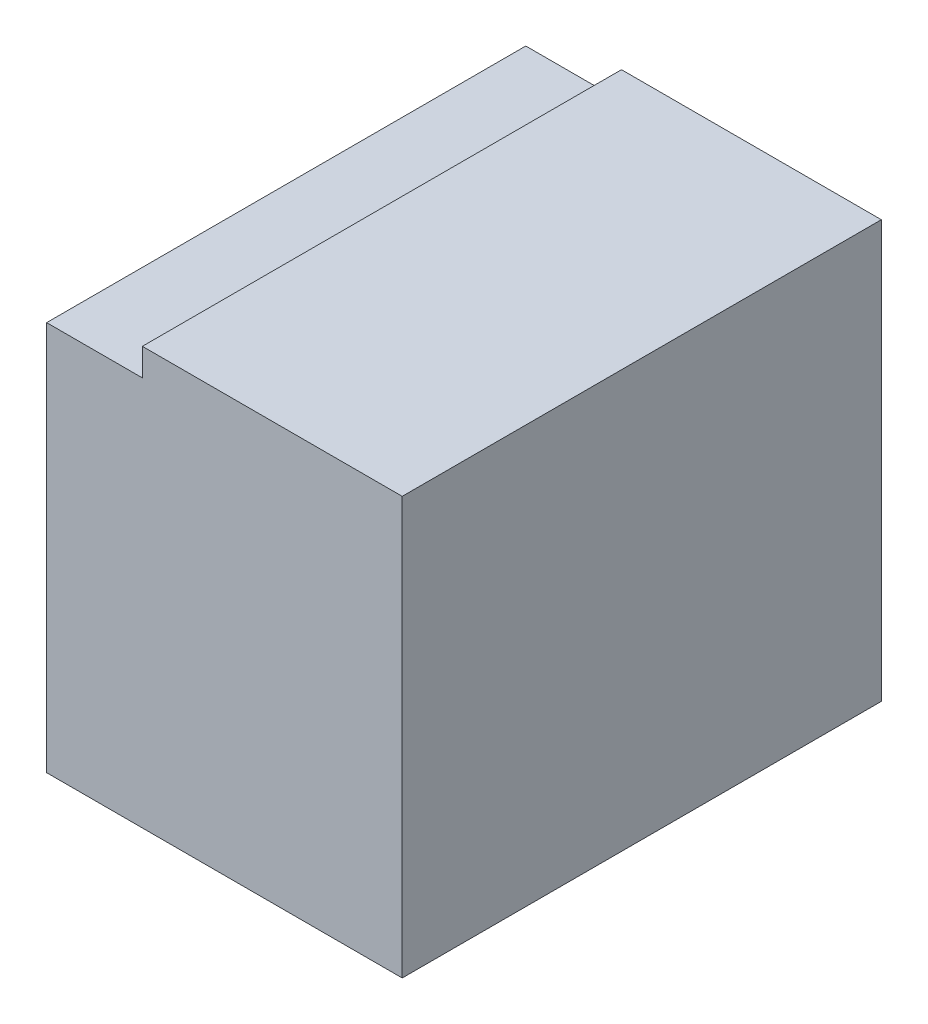
ISO-10303-21;
HEADER;
FILE_DESCRIPTION(('STEP AP214'),'2;1');
FILE_NAME('part.step','',(''),(''),'','','');
FILE_SCHEMA(('AUTOMOTIVE_DESIGN { 1 0 10303 214 1 1 1 1 }'));
ENDSEC;
DATA;
#1=APPLICATION_CONTEXT('core data for automotive mechanical design processes');
#2=APPLICATION_PROTOCOL_DEFINITION('international standard','automotive_design',2000,#1);
#3=PRODUCT_CONTEXT('',#1,'mechanical');
#4=PRODUCT('Part','Part','',(#3));
#5=PRODUCT_RELATED_PRODUCT_CATEGORY('part','',(#4));
#6=PRODUCT_DEFINITION_FORMATION('','',#4);
#7=PRODUCT_DEFINITION_CONTEXT('part definition',#1,'design');
#8=PRODUCT_DEFINITION('design','',#6,#7);
#9=PRODUCT_DEFINITION_SHAPE('','',#8);
#10=(LENGTH_UNIT() NAMED_UNIT(*) SI_UNIT(.MILLI.,.METRE.));
#11=(NAMED_UNIT(*) PLANE_ANGLE_UNIT() SI_UNIT($,.RADIAN.));
#12=(NAMED_UNIT(*) SI_UNIT($,.STERADIAN.) SOLID_ANGLE_UNIT());
#13=UNCERTAINTY_MEASURE_WITH_UNIT(LENGTH_MEASURE(1.E-05),#10,'distance_accuracy_value','');
#14=(GEOMETRIC_REPRESENTATION_CONTEXT(3) GLOBAL_UNCERTAINTY_ASSIGNED_CONTEXT((#13)) GLOBAL_UNIT_ASSIGNED_CONTEXT((#10,
#11,#12)) REPRESENTATION_CONTEXT('',''));
#15=CARTESIAN_POINT('',(0.,0.,0.));
#16=DIRECTION('',(0.,0.,1.));
#17=DIRECTION('',(1.,0.,0.));
#18=AXIS2_PLACEMENT_3D('',#15,#16,#17);
#19=CARTESIAN_POINT('',(-69.80498377743,-2.051384398456,-41.29331973764));
#20=DIRECTION('',(-1.,1.338607343168E-12,0.));
#21=DIRECTION('',(-1.338607343168E-12,-1.,0.));
#22=AXIS2_PLACEMENT_3D('',#19,#20,#21);
#23=PLANE('',#22);
#24=DIRECTION('',(0.,0.,1.));
#25=VECTOR('',#24,1.);
#26=CARTESIAN_POINT('',(-69.80498377743,-2.126384400525,-44.48106509227));
#27=LINE('',#26,#25);
#28=CARTESIAN_POINT('',(-69.8049837774301,-2.12638440051825,-47.4236397376319));
#29=VERTEX_POINT('',#28);
#30=CARTESIAN_POINT('',(-69.8049837774301,-2.12638440051825,-47.0733197376419));
#31=VERTEX_POINT('',#30);
#32=EDGE_CURVE('E88',#29,#31,#27,.T.);
#33=ORIENTED_EDGE('',*,*,#32,.T.);
#34=DIRECTION('',(0.,-1.,1.798143292204E-12));
#35=VECTOR('',#34,1.);
#36=CARTESIAN_POINT('',(-69.80498377743,-0.806384399451,-47.07331973765));
#37=LINE('',#36,#35);
#38=CARTESIAN_POINT('',(-69.8049837774299,-1.841385122797,-47.073319737642));
#39=VERTEX_POINT('',#38);
#40=EDGE_CURVE('E80',#39,#31,#37,.T.);
#41=ORIENTED_EDGE('',*,*,#40,.F.);
#42=DIRECTION('',(0.,0.,-1.));
#43=VECTOR('',#42,1.);
#44=CARTESIAN_POINT('',(-69.80498377743,-1.841385122797,-47.24863973798));
#45=LINE('',#44,#43);
#46=CARTESIAN_POINT('',(-69.8049837774299,-1.8413850990795,-47.423639737632));
#47=VERTEX_POINT('',#46);
#48=EDGE_CURVE('E19',#39,#47,#45,.T.);
#49=ORIENTED_EDGE('',*,*,#48,.T.);
#50=DIRECTION('',(0.,1.,-1.798143292204E-12));
#51=VECTOR('',#50,1.);
#52=CARTESIAN_POINT('',(-69.80498377743,-0.806384399449,-47.42363973764));
#53=LINE('',#52,#51);
#54=EDGE_CURVE('E70',#29,#47,#53,.T.);
#55=ORIENTED_EDGE('',*,*,#54,.F.);
#56=EDGE_LOOP('',(#33,#41,#49,#55));
#57=FACE_BOUND('',#56,.T.);
#58=ADVANCED_FACE('F16',(#57),#23,.T.);
#59=CARTESIAN_POINT('',(-72.39500445623,-1.841385122797,-47.24863973798));
#60=DIRECTION('',(0.,-1.,0.));
#61=DIRECTION('',(0.,0.,-1.));
#62=AXIS2_PLACEMENT_3D('',#59,#60,#61);
#63=PLANE('',#62);
#64=DIRECTION('',(1.,0.,0.));
#65=VECTOR('',#64,1.);
#66=CARTESIAN_POINT('',(-73.12019237886,-1.841385122797,-47.0733197376481));
#67=LINE('',#66,#65);
#68=CARTESIAN_POINT('',(-69.7350044661175,-1.841385122797,-47.073319737642));
#69=VERTEX_POINT('',#68);
#70=EDGE_CURVE('E99',#69,#39,#67,.F.);
#71=ORIENTED_EDGE('',*,*,#70,.F.);
#72=DIRECTION('',(0.,0.,-1.));
#73=VECTOR('',#72,1.);
#74=CARTESIAN_POINT('',(-69.73500447043,-1.841385122797,-47.24847974281));
#75=LINE('',#74,#73);
#76=CARTESIAN_POINT('',(-69.7350044622475,-1.8413850990795,-47.423639737632));
#77=VERTEX_POINT('',#76);
#78=EDGE_CURVE('E77',#69,#77,#75,.T.);
#79=ORIENTED_EDGE('',*,*,#78,.T.);
#80=DIRECTION('',(1.,0.,0.));
#81=VECTOR('',#80,1.);
#82=CARTESIAN_POINT('',(-74.98500392881,-1.841385027927,-47.4236397376381));
#83=LINE('',#82,#81);
#84=EDGE_CURVE('E66',#47,#77,#83,.T.);
#85=ORIENTED_EDGE('',*,*,#84,.F.);
#86=ORIENTED_EDGE('',*,*,#48,.F.);
#87=EDGE_LOOP('',(#71,#79,#85,#86));
#88=FACE_BOUND('',#87,.T.);
#89=ADVANCED_FACE('F84',(#88),#63,.F.);
#90=CARTESIAN_POINT('',(-69.73500447043,-1.691384921744,-47.24847974281));
#91=DIRECTION('',(1.,0.,0.));
#92=DIRECTION('',(0.,0.,-1.));
#93=AXIS2_PLACEMENT_3D('',#90,#91,#92);
#94=PLANE('',#93);
#95=DIRECTION('',(0.,1.,-1.798143292204E-12));
#96=VECTOR('',#95,1.);
#97=CARTESIAN_POINT('',(-69.73500445952,-0.806384399449,-47.42363973764));
#98=LINE('',#97,#96);
#99=CARTESIAN_POINT('',(-69.73500446327,-1.821384382683,-47.4236397376341));
#100=VERTEX_POINT('',#99);
#101=EDGE_CURVE('E86',#77,#100,#98,.T.);
#102=ORIENTED_EDGE('',*,*,#101,.F.);
#103=ORIENTED_EDGE('',*,*,#78,.F.);
#104=DIRECTION('',(0.,-1.,1.798143292204E-12));
#105=VECTOR('',#104,1.);
#106=CARTESIAN_POINT('',(-69.73500446409,-0.806384399451,-47.07331973765));
#107=LINE('',#106,#105);
#108=CARTESIAN_POINT('',(-69.735004465555,-1.821384394565,-47.0733197376441));
#109=VERTEX_POINT('',#108);
#110=EDGE_CURVE('E96',#109,#69,#107,.T.);
#111=ORIENTED_EDGE('',*,*,#110,.F.);
#112=DIRECTION('',(0.,0.,1.));
#113=VECTOR('',#112,1.);
#114=CARTESIAN_POINT('',(-69.73500446361,-1.821384400506,-47.24863973729));
#115=LINE('',#114,#113);
#116=EDGE_CURVE('E105',#100,#109,#115,.T.);
#117=ORIENTED_EDGE('',*,*,#116,.F.);
#118=EDGE_LOOP('',(#102,#103,#111,#117));
#119=FACE_BOUND('',#118,.T.);
#120=ADVANCED_FACE('F131',(#119),#94,.F.);
#121=CARTESIAN_POINT('',(-74.98500392881,-0.806384399449,-47.42363973764));
#122=DIRECTION('',(0.,-1.798143292204E-12,-1.));
#123=DIRECTION('',(0.,1.,-1.798143292204E-12));
#124=AXIS2_PLACEMENT_3D('',#121,#122,#123);
#125=PLANE('',#124);
#126=ORIENTED_EDGE('',*,*,#84,.T.);
#127=ORIENTED_EDGE('',*,*,#101,.T.);
#128=DIRECTION('',(1.,0.,0.));
#129=VECTOR('',#128,1.);
#130=CARTESIAN_POINT('',(-72.3950044578,-1.821384400506,-47.42363973763));
#131=LINE('',#130,#129);
#132=CARTESIAN_POINT('',(-69.545004437785,-1.821384388624,-47.4236397376341));
#133=VERTEX_POINT('',#132);
#134=EDGE_CURVE('E102',#133,#100,#131,.F.);
#135=ORIENTED_EDGE('',*,*,#134,.F.);
#136=DIRECTION('',(0.,1.,0.));
#137=VECTOR('',#136,1.);
#138=CARTESIAN_POINT('',(-69.54500443493,-2.057013797608,-47.42363973763));
#139=LINE('',#138,#137);
#140=CARTESIAN_POINT('',(-69.545004437785,-2.12638440051825,-47.4236397376338));
#141=VERTEX_POINT('',#140);
#142=EDGE_CURVE('E107',#133,#141,#139,.F.);
#143=ORIENTED_EDGE('',*,*,#142,.T.);
#144=DIRECTION('',(1.,0.,0.));
#145=VECTOR('',#144,1.);
#146=CARTESIAN_POINT('',(-72.08658338126,-2.126384400525,-47.42363973763));
#147=LINE('',#146,#145);
#148=EDGE_CURVE('E74',#141,#29,#147,.F.);
#149=ORIENTED_EDGE('',*,*,#148,.T.);
#150=ORIENTED_EDGE('',*,*,#54,.T.);
#151=EDGE_LOOP('',(#126,#127,#135,#143,#149,#150));
#152=FACE_BOUND('',#151,.T.);
#153=ADVANCED_FACE('F72',(#152),#125,.T.);
#154=CARTESIAN_POINT('',(-72.08658338126,-2.126384400525,-44.48106509227));
#155=DIRECTION('',(0.,1.,0.));
#156=DIRECTION('',(0.,0.,1.));
#157=AXIS2_PLACEMENT_3D('',#154,#155,#156);
#158=PLANE('',#157);
#159=DIRECTION('',(0.,0.,1.));
#160=VECTOR('',#159,1.);
#161=CARTESIAN_POINT('',(-69.54500443493,-2.126384400516,-47.7884795988));
#162=LINE('',#161,#160);
#163=CARTESIAN_POINT('',(-69.54500443493,-2.1263844005205,-47.0733197376419));
#164=VERTEX_POINT('',#163);
#165=EDGE_CURVE('E109',#141,#164,#162,.T.);
#166=ORIENTED_EDGE('',*,*,#165,.T.);
#167=DIRECTION('',(1.,0.,0.));
#168=VECTOR('',#167,1.);
#169=CARTESIAN_POINT('',(-73.12019237886,-2.126384400516,-47.0733197376476));
#170=LINE('',#169,#168);
#171=EDGE_CURVE('E94',#31,#164,#170,.T.);
#172=ORIENTED_EDGE('',*,*,#171,.F.);
#173=ORIENTED_EDGE('',*,*,#32,.F.);
#174=ORIENTED_EDGE('',*,*,#148,.F.);
#175=EDGE_LOOP('',(#166,#172,#173,#174));
#176=FACE_BOUND('',#175,.T.);
#177=ADVANCED_FACE('F121',(#176),#158,.F.);
#178=CARTESIAN_POINT('',(-73.12019237886,-0.806384399451,-47.07331973765));
#179=DIRECTION('',(0.,1.798143292204E-12,1.));
#180=DIRECTION('',(0.,-1.,1.798143292204E-12));
#181=AXIS2_PLACEMENT_3D('',#178,#179,#180);
#182=PLANE('',#181);
#183=ORIENTED_EDGE('',*,*,#110,.T.);
#184=ORIENTED_EDGE('',*,*,#70,.T.);
#185=ORIENTED_EDGE('',*,*,#40,.T.);
#186=ORIENTED_EDGE('',*,*,#171,.T.);
#187=DIRECTION('',(0.,1.,0.));
#188=VECTOR('',#187,1.);
#189=CARTESIAN_POINT('',(-69.54500443493,-2.057013797608,-47.07331973764));
#190=LINE('',#189,#188);
#191=CARTESIAN_POINT('',(-69.54500443493,-1.821384400506,-47.0733197376441));
#192=VERTEX_POINT('',#191);
#193=EDGE_CURVE('E25',#164,#192,#190,.T.);
#194=ORIENTED_EDGE('',*,*,#193,.T.);
#195=DIRECTION('',(1.,0.,0.));
#196=VECTOR('',#195,1.);
#197=CARTESIAN_POINT('',(-72.3950044578,-1.821384400506,-47.07331973764));
#198=LINE('',#197,#196);
#199=EDGE_CURVE('E33',#109,#192,#198,.T.);
#200=ORIENTED_EDGE('',*,*,#199,.F.);
#201=EDGE_LOOP('',(#183,#184,#185,#186,#194,#200));
#202=FACE_BOUND('',#201,.T.);
#203=ADVANCED_FACE('F115',(#202),#182,.T.);
#204=CARTESIAN_POINT('',(-72.3950044578,-1.821384400506,-47.24863973729));
#205=DIRECTION('',(0.,1.,0.));
#206=DIRECTION('',(0.,0.,1.));
#207=AXIS2_PLACEMENT_3D('',#204,#205,#206);
#208=PLANE('',#207);
#209=ORIENTED_EDGE('',*,*,#134,.T.);
#210=ORIENTED_EDGE('',*,*,#116,.T.);
#211=ORIENTED_EDGE('',*,*,#199,.T.);
#212=DIRECTION('',(0.,0.,1.));
#213=VECTOR('',#212,1.);
#214=CARTESIAN_POINT('',(-69.54500443493,-1.821384400506,-47.7884795988));
#215=LINE('',#214,#213);
#216=EDGE_CURVE('E11',#192,#133,#215,.F.);
#217=ORIENTED_EDGE('',*,*,#216,.T.);
#218=EDGE_LOOP('',(#209,#210,#211,#217));
#219=FACE_BOUND('',#218,.T.);
#220=ADVANCED_FACE('F129',(#219),#208,.T.);
#221=CARTESIAN_POINT('',(-69.54500443493,-2.057013797608,-47.7884795988));
#222=DIRECTION('',(-1.,0.,0.));
#223=DIRECTION('',(0.,0.,1.));
#224=AXIS2_PLACEMENT_3D('',#221,#222,#223);
#225=PLANE('',#224);
#226=ORIENTED_EDGE('',*,*,#193,.F.);
#227=ORIENTED_EDGE('',*,*,#165,.F.);
#228=ORIENTED_EDGE('',*,*,#142,.F.);
#229=ORIENTED_EDGE('',*,*,#216,.F.);
#230=EDGE_LOOP('',(#226,#227,#228,#229));
#231=FACE_BOUND('',#230,.T.);
#232=ADVANCED_FACE('F119',(#231),#225,.F.);
#233=CLOSED_SHELL('',(#58,#89,#120,#153,#177,#203,#220,#232));
#234=MANIFOLD_SOLID_BREP('B1',#233);
#235=ADVANCED_BREP_SHAPE_REPRESENTATION('',(#18,#234),#14);
#236=SHAPE_DEFINITION_REPRESENTATION(#9,#235);
ENDSEC;
END-ISO-10303-21;
